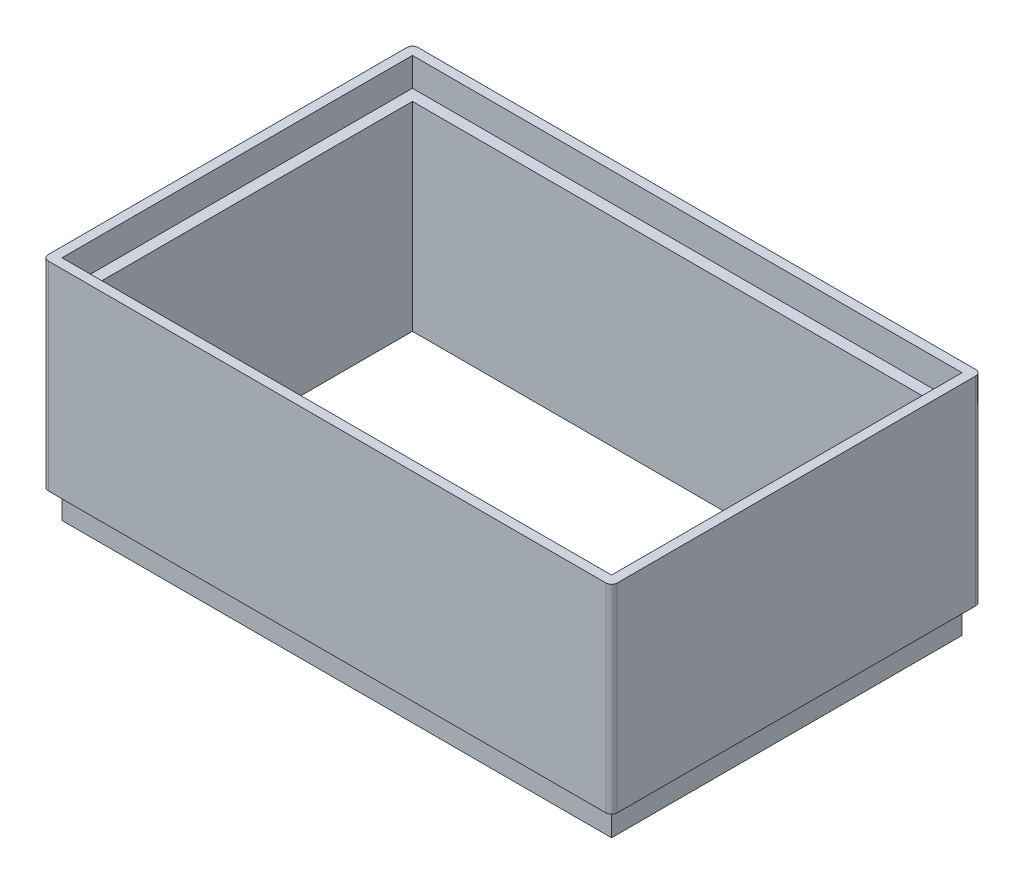
ISO-10303-21;
HEADER;
FILE_DESCRIPTION(('STEP AP214'),'2;1');
FILE_NAME('part.step','',(''),(''),'','','');
FILE_SCHEMA(('AUTOMOTIVE_DESIGN { 1 0 10303 214 1 1 1 1 }'));
ENDSEC;
DATA;
#1=APPLICATION_CONTEXT('core data for automotive mechanical design processes');
#2=APPLICATION_PROTOCOL_DEFINITION('international standard','automotive_design',2000,#1);
#3=PRODUCT_CONTEXT('',#1,'mechanical');
#4=PRODUCT('Part','Part','',(#3));
#5=PRODUCT_RELATED_PRODUCT_CATEGORY('part','',(#4));
#6=PRODUCT_DEFINITION_FORMATION('','',#4);
#7=PRODUCT_DEFINITION_CONTEXT('part definition',#1,'design');
#8=PRODUCT_DEFINITION('design','',#6,#7);
#9=PRODUCT_DEFINITION_SHAPE('','',#8);
#10=(LENGTH_UNIT() NAMED_UNIT(*) SI_UNIT(.MILLI.,.METRE.));
#11=(NAMED_UNIT(*) PLANE_ANGLE_UNIT() SI_UNIT($,.RADIAN.));
#12=(NAMED_UNIT(*) SI_UNIT($,.STERADIAN.) SOLID_ANGLE_UNIT());
#13=UNCERTAINTY_MEASURE_WITH_UNIT(LENGTH_MEASURE(1.E-05),#10,'distance_accuracy_value','');
#14=(GEOMETRIC_REPRESENTATION_CONTEXT(3) GLOBAL_UNCERTAINTY_ASSIGNED_CONTEXT((#13)) GLOBAL_UNIT_ASSIGNED_CONTEXT((#10,
#11,#12)) REPRESENTATION_CONTEXT('',''));
#15=CARTESIAN_POINT('',(0.,0.,0.));
#16=DIRECTION('',(0.,0.,1.));
#17=DIRECTION('',(1.,0.,0.));
#18=AXIS2_PLACEMENT_3D('',#15,#16,#17);
#19=CARTESIAN_POINT('',(47.5395437262358,80.002,-39.1555133079848));
#20=DIRECTION('',(0.,0.,-1.));
#21=DIRECTION('',(-1.,0.,0.));
#22=AXIS2_PLACEMENT_3D('',#19,#20,#21);
#23=PLANE('',#22);
#24=DIRECTION('',(1.,0.,0.));
#25=VECTOR('',#24,1.);
#26=CARTESIAN_POINT('',(47.5395437262358,70.,-39.1555133079848));
#27=LINE('',#26,#25);
#28=CARTESIAN_POINT('',(-45.0604562737642,70.,-39.1555133079848));
#29=VERTEX_POINT('',#28);
#30=CARTESIAN_POINT('',(47.5395437262358,70.,-39.1555133079848));
#31=VERTEX_POINT('',#30);
#32=EDGE_CURVE('E209',#29,#31,#27,.T.);
#33=ORIENTED_EDGE('',*,*,#32,.F.);
#34=DIRECTION('',(0.,-1.,0.));
#35=VECTOR('',#34,1.);
#36=CARTESIAN_POINT('',(-45.0604562737642,80.002,-39.1555133079848));
#37=LINE('',#36,#35);
#38=CARTESIAN_POINT('',(-45.0604562737642,35.,-39.1555133079848));
#39=VERTEX_POINT('',#38);
#40=EDGE_CURVE('E318',#29,#39,#37,.T.);
#41=ORIENTED_EDGE('',*,*,#40,.T.);
#42=DIRECTION('',(1.,0.,0.));
#43=VECTOR('',#42,1.);
#44=CARTESIAN_POINT('',(47.5395437262358,35.,-39.1555133079848));
#45=LINE('',#44,#43);
#46=CARTESIAN_POINT('',(47.5395437262358,35.,-39.1555133079848));
#47=VERTEX_POINT('',#46);
#48=EDGE_CURVE('E263',#39,#47,#45,.T.);
#49=ORIENTED_EDGE('',*,*,#48,.T.);
#50=DIRECTION('',(0.,-1.,0.));
#51=VECTOR('',#50,1.);
#52=CARTESIAN_POINT('',(47.5395437262358,80.002,-39.1555133079848));
#53=LINE('',#52,#51);
#54=EDGE_CURVE('E235',#31,#47,#53,.T.);
#55=ORIENTED_EDGE('',*,*,#54,.F.);
#56=EDGE_LOOP('',(#33,#41,#49,#55));
#57=FACE_BOUND('',#56,.T.);
#58=ADVANCED_FACE('F32',(#57),#23,.F.);
#59=CARTESIAN_POINT('',(-45.0604562737642,80.002,-39.1555133079848));
#60=DIRECTION('',(-1.,0.,0.));
#61=DIRECTION('',(0.,0.,1.));
#62=AXIS2_PLACEMENT_3D('',#59,#60,#61);
#63=PLANE('',#62);
#64=DIRECTION('',(0.,0.,-1.));
#65=VECTOR('',#64,1.);
#66=CARTESIAN_POINT('',(-45.0604562737642,70.,-39.1555133079848));
#67=LINE('',#66,#65);
#68=CARTESIAN_POINT('',(-45.0604562737642,70.,18.4444866920152));
#69=VERTEX_POINT('',#68);
#70=EDGE_CURVE('E207',#69,#29,#67,.T.);
#71=ORIENTED_EDGE('',*,*,#70,.F.);
#72=DIRECTION('',(0.,-1.,0.));
#73=VECTOR('',#72,1.);
#74=CARTESIAN_POINT('',(-45.0604562737642,80.002,18.4444866920152));
#75=LINE('',#74,#73);
#76=CARTESIAN_POINT('',(-45.0604562737642,35.,18.4444866920152));
#77=VERTEX_POINT('',#76);
#78=EDGE_CURVE('E320',#69,#77,#75,.T.);
#79=ORIENTED_EDGE('',*,*,#78,.T.);
#80=DIRECTION('',(0.,0.,-1.));
#81=VECTOR('',#80,1.);
#82=CARTESIAN_POINT('',(-45.0604562737642,35.,-39.1555133079848));
#83=LINE('',#82,#81);
#84=EDGE_CURVE('E273',#77,#39,#83,.T.);
#85=ORIENTED_EDGE('',*,*,#84,.T.);
#86=ORIENTED_EDGE('',*,*,#40,.F.);
#87=EDGE_LOOP('',(#71,#79,#85,#86));
#88=FACE_BOUND('',#87,.T.);
#89=ADVANCED_FACE('F337',(#88),#63,.F.);
#90=CARTESIAN_POINT('',(47.5395437262358,80.002,-39.1555133079848));
#91=DIRECTION('',(1.,0.,0.));
#92=DIRECTION('',(0.,0.,-1.));
#93=AXIS2_PLACEMENT_3D('',#90,#91,#92);
#94=PLANE('',#93);
#95=DIRECTION('',(0.,0.,1.));
#96=VECTOR('',#95,1.);
#97=CARTESIAN_POINT('',(47.5395437262358,70.,-39.1555133079848));
#98=LINE('',#97,#96);
#99=CARTESIAN_POINT('',(47.5395437262358,70.,18.4444866920152));
#100=VERTEX_POINT('',#99);
#101=EDGE_CURVE('E54',#31,#100,#98,.T.);
#102=ORIENTED_EDGE('',*,*,#101,.F.);
#103=ORIENTED_EDGE('',*,*,#54,.T.);
#104=DIRECTION('',(0.,0.,1.));
#105=VECTOR('',#104,1.);
#106=CARTESIAN_POINT('',(47.5395437262358,35.,-39.1555133079848));
#107=LINE('',#106,#105);
#108=CARTESIAN_POINT('',(47.5395437262358,35.,18.4444866920152));
#109=VERTEX_POINT('',#108);
#110=EDGE_CURVE('E40',#47,#109,#107,.T.);
#111=ORIENTED_EDGE('',*,*,#110,.T.);
#112=DIRECTION('',(0.,-1.,0.));
#113=VECTOR('',#112,1.);
#114=CARTESIAN_POINT('',(47.5395437262358,80.002,18.4444866920152));
#115=LINE('',#114,#113);
#116=EDGE_CURVE('E240',#100,#109,#115,.T.);
#117=ORIENTED_EDGE('',*,*,#116,.F.);
#118=EDGE_LOOP('',(#102,#103,#111,#117));
#119=FACE_BOUND('',#118,.T.);
#120=ADVANCED_FACE('F329',(#119),#94,.F.);
#121=CARTESIAN_POINT('',(47.5395437262358,80.002,18.4444866920152));
#122=DIRECTION('',(0.,0.,1.));
#123=DIRECTION('',(1.,0.,0.));
#124=AXIS2_PLACEMENT_3D('',#121,#122,#123);
#125=PLANE('',#124);
#126=DIRECTION('',(-1.,0.,0.));
#127=VECTOR('',#126,1.);
#128=CARTESIAN_POINT('',(47.5395437262358,70.,18.4444866920152));
#129=LINE('',#128,#127);
#130=EDGE_CURVE('E11',#100,#69,#129,.T.);
#131=ORIENTED_EDGE('',*,*,#130,.F.);
#132=ORIENTED_EDGE('',*,*,#116,.T.);
#133=DIRECTION('',(-1.,0.,0.));
#134=VECTOR('',#133,1.);
#135=CARTESIAN_POINT('',(47.5395437262358,35.,18.4444866920152));
#136=LINE('',#135,#134);
#137=EDGE_CURVE('E276',#109,#77,#136,.T.);
#138=ORIENTED_EDGE('',*,*,#137,.T.);
#139=ORIENTED_EDGE('',*,*,#78,.F.);
#140=EDGE_LOOP('',(#131,#132,#138,#139));
#141=FACE_BOUND('',#140,.T.);
#142=ADVANCED_FACE('F323',(#141),#125,.F.);
#143=CARTESIAN_POINT('',(0.,75.,0.));
#144=DIRECTION('',(0.,1.,0.));
#145=DIRECTION('',(0.,0.,1.));
#146=AXIS2_PLACEMENT_3D('',#143,#144,#145);
#147=PLANE('',#146);
#148=DIRECTION('',(0.,0.,1.));
#149=VECTOR('',#148,1.);
#150=CARTESIAN_POINT('',(-47.0604562737643,75.,-41.1555133079848));
#151=LINE('',#150,#149);
#152=CARTESIAN_POINT('',(-47.0604562737643,75.,-41.1555133079848));
#153=VERTEX_POINT('',#152);
#154=CARTESIAN_POINT('',(-47.0604562737643,75.,20.4444866920152));
#155=VERTEX_POINT('',#154);
#156=EDGE_CURVE('E47',#153,#155,#151,.T.);
#157=ORIENTED_EDGE('',*,*,#156,.F.);
#158=DIRECTION('',(-1.,0.,0.));
#159=VECTOR('',#158,1.);
#160=CARTESIAN_POINT('',(-47.0604562737643,75.,-41.1555133079848));
#161=LINE('',#160,#159);
#162=CARTESIAN_POINT('',(49.5395437262358,75.,-41.1555133079848));
#163=VERTEX_POINT('',#162);
#164=EDGE_CURVE('E188',#163,#153,#161,.T.);
#165=ORIENTED_EDGE('',*,*,#164,.F.);
#166=DIRECTION('',(0.,0.,-1.));
#167=VECTOR('',#166,1.);
#168=CARTESIAN_POINT('',(49.5395437262358,75.,-41.1555133079848));
#169=LINE('',#168,#167);
#170=CARTESIAN_POINT('',(49.5395437262358,75.,20.4444866920152));
#171=VERTEX_POINT('',#170);
#172=EDGE_CURVE('E191',#171,#163,#169,.T.);
#173=ORIENTED_EDGE('',*,*,#172,.F.);
#174=DIRECTION('',(1.,0.,0.));
#175=VECTOR('',#174,1.);
#176=CARTESIAN_POINT('',(-47.0604562737643,75.,20.4444866920152));
#177=LINE('',#176,#175);
#178=EDGE_CURVE('E197',#155,#171,#177,.T.);
#179=ORIENTED_EDGE('',*,*,#178,.F.);
#180=EDGE_LOOP('',(#157,#165,#173,#179));
#181=FACE_BOUND('',#180,.T.);
#182=CARTESIAN_POINT('',(-47.7604562737643,75.,21.1444866920152));
#183=DIRECTION('',(0.,1.,0.));
#184=DIRECTION('',(0.,0.,1.));
#185=AXIS2_PLACEMENT_3D('',#182,#183,#184);
#186=CIRCLE('',#185,1.);
#187=CARTESIAN_POINT('',(-47.7604562737643,75.,22.1444866920152));
#188=VERTEX_POINT('',#187);
#189=CARTESIAN_POINT('',(-48.7604562737643,75.,21.1444866920152));
#190=VERTEX_POINT('',#189);
#191=EDGE_CURVE('E286',#188,#190,#186,.F.);
#192=ORIENTED_EDGE('',*,*,#191,.F.);
#193=DIRECTION('',(1.,0.,0.));
#194=VECTOR('',#193,1.);
#195=CARTESIAN_POINT('',(-48.7604562737643,75.,22.1444866920152));
#196=LINE('',#195,#194);
#197=CARTESIAN_POINT('',(50.2395437262358,75.,22.1444866920152));
#198=VERTEX_POINT('',#197);
#199=EDGE_CURVE('E288',#188,#198,#196,.T.);
#200=ORIENTED_EDGE('',*,*,#199,.T.);
#201=CARTESIAN_POINT('',(50.2395437262358,75.,21.1444866920152));
#202=DIRECTION('',(0.,1.,0.));
#203=DIRECTION('',(0.,0.,1.));
#204=AXIS2_PLACEMENT_3D('',#201,#202,#203);
#205=CIRCLE('',#204,1.);
#206=CARTESIAN_POINT('',(51.2395437262358,75.,21.1444866920152));
#207=VERTEX_POINT('',#206);
#208=EDGE_CURVE('E282',#207,#198,#205,.F.);
#209=ORIENTED_EDGE('',*,*,#208,.F.);
#210=DIRECTION('',(0.,0.,-1.));
#211=VECTOR('',#210,1.);
#212=CARTESIAN_POINT('',(51.2395437262357,75.,-42.8555133079848));
#213=LINE('',#212,#211);
#214=CARTESIAN_POINT('',(51.2395437262357,75.,-41.8555133079848));
#215=VERTEX_POINT('',#214);
#216=EDGE_CURVE('E294',#207,#215,#213,.T.);
#217=ORIENTED_EDGE('',*,*,#216,.T.);
#218=CARTESIAN_POINT('',(50.2395437262357,75.,-41.8555133079848));
#219=DIRECTION('',(0.,1.,0.));
#220=DIRECTION('',(0.,0.,1.));
#221=AXIS2_PLACEMENT_3D('',#218,#219,#220);
#222=CIRCLE('',#221,1.);
#223=CARTESIAN_POINT('',(50.2395437262357,75.,-42.8555133079848));
#224=VERTEX_POINT('',#223);
#225=EDGE_CURVE('E215',#224,#215,#222,.F.);
#226=ORIENTED_EDGE('',*,*,#225,.F.);
#227=DIRECTION('',(-1.,0.,0.));
#228=VECTOR('',#227,1.);
#229=CARTESIAN_POINT('',(-48.7604562737643,75.,-42.8555133079848));
#230=LINE('',#229,#228);
#231=CARTESIAN_POINT('',(-47.7604562737643,75.,-42.8555133079848));
#232=VERTEX_POINT('',#231);
#233=EDGE_CURVE('E211',#224,#232,#230,.T.);
#234=ORIENTED_EDGE('',*,*,#233,.T.);
#235=CARTESIAN_POINT('',(-47.7604562737643,75.,-41.8555133079848));
#236=DIRECTION('',(0.,1.,0.));
#237=DIRECTION('',(0.,0.,1.));
#238=AXIS2_PLACEMENT_3D('',#235,#236,#237);
#239=CIRCLE('',#238,1.);
#240=CARTESIAN_POINT('',(-48.7604562737643,75.,-41.8555133079848));
#241=VERTEX_POINT('',#240);
#242=EDGE_CURVE('E284',#241,#232,#239,.F.);
#243=ORIENTED_EDGE('',*,*,#242,.F.);
#244=DIRECTION('',(0.,0.,1.));
#245=VECTOR('',#244,1.);
#246=CARTESIAN_POINT('',(-48.7604562737643,75.,-42.8555133079848));
#247=LINE('',#246,#245);
#248=EDGE_CURVE('E291',#241,#190,#247,.T.);
#249=ORIENTED_EDGE('',*,*,#248,.T.);
#250=EDGE_LOOP('',(#192,#200,#209,#217,#226,#234,#243,#249));
#251=FACE_BOUND('',#250,.T.);
#252=ADVANCED_FACE('F353',(#181,#251),#147,.T.);
#253=CARTESIAN_POINT('',(-47.0604562737643,35.,-41.1555133079848));
#254=DIRECTION('',(0.,0.,1.));
#255=DIRECTION('',(1.,0.,0.));
#256=AXIS2_PLACEMENT_3D('',#253,#254,#255);
#257=PLANE('',#256);
#258=DIRECTION('',(1.,0.,0.));
#259=VECTOR('',#258,1.);
#260=CARTESIAN_POINT('',(-47.0604562737643,40.,-41.1555133079848));
#261=LINE('',#260,#259);
#262=CARTESIAN_POINT('',(-47.0604562737643,40.,-41.1555133079848));
#263=VERTEX_POINT('',#262);
#264=CARTESIAN_POINT('',(49.5395437262358,40.,-41.1555133079848));
#265=VERTEX_POINT('',#264);
#266=EDGE_CURVE('E257',#263,#265,#261,.T.);
#267=ORIENTED_EDGE('',*,*,#266,.T.);
#268=DIRECTION('',(0.,1.,0.));
#269=VECTOR('',#268,1.);
#270=CARTESIAN_POINT('',(49.5395437262358,35.,-41.1555133079848));
#271=LINE('',#270,#269);
#272=CARTESIAN_POINT('',(49.5395437262358,35.,-41.1555133079848));
#273=VERTEX_POINT('',#272);
#274=EDGE_CURVE('E239',#273,#265,#271,.T.);
#275=ORIENTED_EDGE('',*,*,#274,.F.);
#276=DIRECTION('',(1.,0.,0.));
#277=VECTOR('',#276,1.);
#278=CARTESIAN_POINT('',(-47.0604562737643,35.,-41.1555133079848));
#279=LINE('',#278,#277);
#280=CARTESIAN_POINT('',(-47.0604562737643,35.,-41.1555133079848));
#281=VERTEX_POINT('',#280);
#282=EDGE_CURVE('E267',#281,#273,#279,.T.);
#283=ORIENTED_EDGE('',*,*,#282,.F.);
#284=DIRECTION('',(0.,1.,0.));
#285=VECTOR('',#284,1.);
#286=CARTESIAN_POINT('',(-47.0604562737643,35.,-41.1555133079848));
#287=LINE('',#286,#285);
#288=EDGE_CURVE('E236',#281,#263,#287,.T.);
#289=ORIENTED_EDGE('',*,*,#288,.T.);
#290=EDGE_LOOP('',(#267,#275,#283,#289));
#291=FACE_BOUND('',#290,.T.);
#292=ADVANCED_FACE('F354',(#291),#257,.F.);
#293=CARTESIAN_POINT('',(49.5395437262358,35.,20.4444866920152));
#294=DIRECTION('',(-1.,0.,0.));
#295=DIRECTION('',(0.,0.,1.));
#296=AXIS2_PLACEMENT_3D('',#293,#294,#295);
#297=PLANE('',#296);
#298=DIRECTION('',(0.,0.,1.));
#299=VECTOR('',#298,1.);
#300=CARTESIAN_POINT('',(49.5395437262358,40.,20.4444866920152));
#301=LINE('',#300,#299);
#302=CARTESIAN_POINT('',(49.5395437262358,40.,20.4444866920152));
#303=VERTEX_POINT('',#302);
#304=EDGE_CURVE('E253',#265,#303,#301,.T.);
#305=ORIENTED_EDGE('',*,*,#304,.T.);
#306=DIRECTION('',(0.,1.,0.));
#307=VECTOR('',#306,1.);
#308=CARTESIAN_POINT('',(49.5395437262358,35.,20.4444866920152));
#309=LINE('',#308,#307);
#310=CARTESIAN_POINT('',(49.5395437262358,35.,20.4444866920152));
#311=VERTEX_POINT('',#310);
#312=EDGE_CURVE('E243',#311,#303,#309,.T.);
#313=ORIENTED_EDGE('',*,*,#312,.F.);
#314=DIRECTION('',(0.,0.,1.));
#315=VECTOR('',#314,1.);
#316=CARTESIAN_POINT('',(49.5395437262358,35.,20.4444866920152));
#317=LINE('',#316,#315);
#318=EDGE_CURVE('E265',#273,#311,#317,.T.);
#319=ORIENTED_EDGE('',*,*,#318,.F.);
#320=ORIENTED_EDGE('',*,*,#274,.T.);
#321=EDGE_LOOP('',(#305,#313,#319,#320));
#322=FACE_BOUND('',#321,.T.);
#323=ADVANCED_FACE('F423',(#322),#297,.F.);
#324=CARTESIAN_POINT('',(-47.0604562737643,35.,20.4444866920152));
#325=DIRECTION('',(0.,0.,-1.));
#326=DIRECTION('',(-1.,0.,0.));
#327=AXIS2_PLACEMENT_3D('',#324,#325,#326);
#328=PLANE('',#327);
#329=DIRECTION('',(-1.,0.,0.));
#330=VECTOR('',#329,1.);
#331=CARTESIAN_POINT('',(-47.0604562737643,40.,20.4444866920152));
#332=LINE('',#331,#330);
#333=CARTESIAN_POINT('',(-47.0604562737643,40.,20.4444866920152));
#334=VERTEX_POINT('',#333);
#335=EDGE_CURVE('E250',#303,#334,#332,.T.);
#336=ORIENTED_EDGE('',*,*,#335,.T.);
#337=DIRECTION('',(0.,1.,0.));
#338=VECTOR('',#337,1.);
#339=CARTESIAN_POINT('',(-47.0604562737643,35.,20.4444866920152));
#340=LINE('',#339,#338);
#341=CARTESIAN_POINT('',(-47.0604562737643,35.,20.4444866920152));
#342=VERTEX_POINT('',#341);
#343=EDGE_CURVE('E246',#342,#334,#340,.T.);
#344=ORIENTED_EDGE('',*,*,#343,.F.);
#345=DIRECTION('',(-1.,0.,0.));
#346=VECTOR('',#345,1.);
#347=CARTESIAN_POINT('',(-47.0604562737643,35.,20.4444866920152));
#348=LINE('',#347,#346);
#349=EDGE_CURVE('E249',#311,#342,#348,.T.);
#350=ORIENTED_EDGE('',*,*,#349,.F.);
#351=ORIENTED_EDGE('',*,*,#312,.T.);
#352=EDGE_LOOP('',(#336,#344,#350,#351));
#353=FACE_BOUND('',#352,.T.);
#354=ADVANCED_FACE('F420',(#353),#328,.F.);
#355=CARTESIAN_POINT('',(-47.0604562737643,35.,20.4444866920152));
#356=DIRECTION('',(1.,0.,0.));
#357=DIRECTION('',(0.,0.,-1.));
#358=AXIS2_PLACEMENT_3D('',#355,#356,#357);
#359=PLANE('',#358);
#360=DIRECTION('',(0.,0.,-1.));
#361=VECTOR('',#360,1.);
#362=CARTESIAN_POINT('',(-47.0604562737643,40.,20.4444866920152));
#363=LINE('',#362,#361);
#364=EDGE_CURVE('E260',#334,#263,#363,.T.);
#365=ORIENTED_EDGE('',*,*,#364,.T.);
#366=ORIENTED_EDGE('',*,*,#288,.F.);
#367=DIRECTION('',(0.,0.,-1.));
#368=VECTOR('',#367,1.);
#369=CARTESIAN_POINT('',(-47.0604562737643,35.,20.4444866920152));
#370=LINE('',#369,#368);
#371=EDGE_CURVE('E254',#342,#281,#370,.T.);
#372=ORIENTED_EDGE('',*,*,#371,.F.);
#373=ORIENTED_EDGE('',*,*,#343,.T.);
#374=EDGE_LOOP('',(#365,#366,#372,#373));
#375=FACE_BOUND('',#374,.T.);
#376=ADVANCED_FACE('F413',(#375),#359,.F.);
#377=CARTESIAN_POINT('',(-48.7604562737643,80.,22.1444866920152));
#378=DIRECTION('',(0.,0.,-1.));
#379=DIRECTION('',(-1.,0.,0.));
#380=AXIS2_PLACEMENT_3D('',#377,#378,#379);
#381=PLANE('',#380);
#382=ORIENTED_EDGE('',*,*,#199,.F.);
#383=DIRECTION('',(0.,-1.,0.));
#384=VECTOR('',#383,1.);
#385=CARTESIAN_POINT('',(-47.7604562737643,80.,22.1444866920152));
#386=LINE('',#385,#384);
#387=CARTESIAN_POINT('',(-47.7604562737643,40.,22.1444866920152));
#388=VERTEX_POINT('',#387);
#389=EDGE_CURVE('E301',#188,#388,#386,.T.);
#390=ORIENTED_EDGE('',*,*,#389,.T.);
#391=DIRECTION('',(1.,0.,0.));
#392=VECTOR('',#391,1.);
#393=CARTESIAN_POINT('',(-48.7604562737643,40.,22.1444866920152));
#394=LINE('',#393,#392);
#395=CARTESIAN_POINT('',(50.2395437262358,40.,22.1444866920152));
#396=VERTEX_POINT('',#395);
#397=EDGE_CURVE('E225',#388,#396,#394,.T.);
#398=ORIENTED_EDGE('',*,*,#397,.T.);
#399=DIRECTION('',(0.,-1.,0.));
#400=VECTOR('',#399,1.);
#401=CARTESIAN_POINT('',(50.2395437262358,80.,22.1444866920152));
#402=LINE('',#401,#400);
#403=EDGE_CURVE('E221',#396,#198,#402,.F.);
#404=ORIENTED_EDGE('',*,*,#403,.T.);
#405=EDGE_LOOP('',(#382,#390,#398,#404));
#406=FACE_BOUND('',#405,.T.);
#407=ADVANCED_FACE('F395',(#406),#381,.F.);
#408=CARTESIAN_POINT('',(0.,40.,0.));
#409=DIRECTION('',(0.,1.,0.));
#410=DIRECTION('',(0.,0.,1.));
#411=AXIS2_PLACEMENT_3D('',#408,#409,#410);
#412=PLANE('',#411);
#413=DIRECTION('',(0.,0.,-1.));
#414=VECTOR('',#413,1.);
#415=CARTESIAN_POINT('',(51.2395437262357,40.,-42.8555133079848));
#416=LINE('',#415,#414);
#417=CARTESIAN_POINT('',(51.2395437262358,40.,21.1444866920152));
#418=VERTEX_POINT('',#417);
#419=CARTESIAN_POINT('',(51.2395437262357,40.,-41.8555133079848));
#420=VERTEX_POINT('',#419);
#421=EDGE_CURVE('E229',#418,#420,#416,.T.);
#422=ORIENTED_EDGE('',*,*,#421,.F.);
#423=CARTESIAN_POINT('',(50.2395437262358,40.,21.1444866920152));
#424=DIRECTION('',(0.,1.,0.));
#425=DIRECTION('',(0.,0.,1.));
#426=AXIS2_PLACEMENT_3D('',#423,#424,#425);
#427=CIRCLE('',#426,1.);
#428=EDGE_CURVE('E212',#418,#396,#427,.F.);
#429=ORIENTED_EDGE('',*,*,#428,.T.);
#430=ORIENTED_EDGE('',*,*,#397,.F.);
#431=CARTESIAN_POINT('',(-47.7604562737643,40.,21.1444866920152));
#432=DIRECTION('',(0.,1.,0.));
#433=DIRECTION('',(0.,0.,1.));
#434=AXIS2_PLACEMENT_3D('',#431,#432,#433);
#435=CIRCLE('',#434,1.);
#436=CARTESIAN_POINT('',(-48.7604562737643,40.,21.1444866920152));
#437=VERTEX_POINT('',#436);
#438=EDGE_CURVE('E214',#388,#437,#435,.F.);
#439=ORIENTED_EDGE('',*,*,#438,.T.);
#440=DIRECTION('',(0.,0.,1.));
#441=VECTOR('',#440,1.);
#442=CARTESIAN_POINT('',(-48.7604562737643,40.,-42.8555133079848));
#443=LINE('',#442,#441);
#444=CARTESIAN_POINT('',(-48.7604562737643,40.,-41.8555133079848));
#445=VERTEX_POINT('',#444);
#446=EDGE_CURVE('E222',#445,#437,#443,.T.);
#447=ORIENTED_EDGE('',*,*,#446,.F.);
#448=CARTESIAN_POINT('',(-47.7604562737643,40.,-41.8555133079848));
#449=DIRECTION('',(0.,1.,0.));
#450=DIRECTION('',(0.,0.,1.));
#451=AXIS2_PLACEMENT_3D('',#448,#449,#450);
#452=CIRCLE('',#451,1.);
#453=CARTESIAN_POINT('',(-47.7604562737643,40.,-42.8555133079848));
#454=VERTEX_POINT('',#453);
#455=EDGE_CURVE('E217',#445,#454,#452,.F.);
#456=ORIENTED_EDGE('',*,*,#455,.T.);
#457=DIRECTION('',(-1.,0.,0.));
#458=VECTOR('',#457,1.);
#459=CARTESIAN_POINT('',(-48.7604562737643,40.,-42.8555133079848));
#460=LINE('',#459,#458);
#461=CARTESIAN_POINT('',(50.2395437262357,40.,-42.8555133079848));
#462=VERTEX_POINT('',#461);
#463=EDGE_CURVE('E232',#462,#454,#460,.T.);
#464=ORIENTED_EDGE('',*,*,#463,.F.);
#465=CARTESIAN_POINT('',(50.2395437262357,40.,-41.8555133079848));
#466=DIRECTION('',(0.,1.,0.));
#467=DIRECTION('',(0.,0.,1.));
#468=AXIS2_PLACEMENT_3D('',#465,#466,#467);
#469=CIRCLE('',#468,1.);
#470=EDGE_CURVE('E219',#462,#420,#469,.F.);
#471=ORIENTED_EDGE('',*,*,#470,.T.);
#472=EDGE_LOOP('',(#422,#429,#430,#439,#447,#456,#464,#471));
#473=FACE_BOUND('',#472,.T.);
#474=ORIENTED_EDGE('',*,*,#364,.F.);
#475=ORIENTED_EDGE('',*,*,#335,.F.);
#476=ORIENTED_EDGE('',*,*,#304,.F.);
#477=ORIENTED_EDGE('',*,*,#266,.F.);
#478=EDGE_LOOP('',(#474,#475,#476,#477));
#479=FACE_BOUND('',#478,.T.);
#480=ADVANCED_FACE('F384',(#473,#479),#412,.F.);
#481=CARTESIAN_POINT('',(51.2395437262357,80.,-42.8555133079848));
#482=DIRECTION('',(-1.,0.,0.));
#483=DIRECTION('',(0.,0.,1.));
#484=AXIS2_PLACEMENT_3D('',#481,#482,#483);
#485=PLANE('',#484);
#486=ORIENTED_EDGE('',*,*,#216,.F.);
#487=DIRECTION('',(0.,-1.,0.));
#488=VECTOR('',#487,1.);
#489=CARTESIAN_POINT('',(51.2395437262358,80.,21.1444866920152));
#490=LINE('',#489,#488);
#491=EDGE_CURVE('E313',#207,#418,#490,.T.);
#492=ORIENTED_EDGE('',*,*,#491,.T.);
#493=ORIENTED_EDGE('',*,*,#421,.T.);
#494=DIRECTION('',(0.,-1.,0.));
#495=VECTOR('',#494,1.);
#496=CARTESIAN_POINT('',(51.2395437262357,80.,-41.8555133079848));
#497=LINE('',#496,#495);
#498=EDGE_CURVE('E226',#420,#215,#497,.F.);
#499=ORIENTED_EDGE('',*,*,#498,.T.);
#500=EDGE_LOOP('',(#486,#492,#493,#499));
#501=FACE_BOUND('',#500,.T.);
#502=ADVANCED_FACE('F381',(#501),#485,.F.);
#503=CARTESIAN_POINT('',(-48.7604562737643,80.,-42.8555133079848));
#504=DIRECTION('',(0.,0.,1.));
#505=DIRECTION('',(1.,0.,0.));
#506=AXIS2_PLACEMENT_3D('',#503,#504,#505);
#507=PLANE('',#506);
#508=ORIENTED_EDGE('',*,*,#233,.F.);
#509=DIRECTION('',(0.,-1.,0.));
#510=VECTOR('',#509,1.);
#511=CARTESIAN_POINT('',(50.2395437262357,80.,-42.8555133079848));
#512=LINE('',#511,#510);
#513=EDGE_CURVE('E311',#224,#462,#512,.T.);
#514=ORIENTED_EDGE('',*,*,#513,.T.);
#515=ORIENTED_EDGE('',*,*,#463,.T.);
#516=DIRECTION('',(0.,-1.,0.));
#517=VECTOR('',#516,1.);
#518=CARTESIAN_POINT('',(-47.7604562737643,80.,-42.8555133079848));
#519=LINE('',#518,#517);
#520=EDGE_CURVE('E308',#454,#232,#519,.F.);
#521=ORIENTED_EDGE('',*,*,#520,.T.);
#522=EDGE_LOOP('',(#508,#514,#515,#521));
#523=FACE_BOUND('',#522,.T.);
#524=ADVANCED_FACE('F373',(#523),#507,.F.);
#525=CARTESIAN_POINT('',(50.2395437262357,80.,-41.8555133079848));
#526=DIRECTION('',(0.,-1.,0.));
#527=DIRECTION('',(0.,0.,-1.));
#528=AXIS2_PLACEMENT_3D('',#525,#526,#527);
#529=CYLINDRICAL_SURFACE('',#528,1.);
#530=ORIENTED_EDGE('',*,*,#513,.F.);
#531=ORIENTED_EDGE('',*,*,#225,.T.);
#532=ORIENTED_EDGE('',*,*,#498,.F.);
#533=ORIENTED_EDGE('',*,*,#470,.F.);
#534=EDGE_LOOP('',(#530,#531,#532,#533));
#535=FACE_BOUND('',#534,.T.);
#536=ADVANCED_FACE('F34',(#535),#529,.T.);
#537=CARTESIAN_POINT('',(50.2395437262358,80.,21.1444866920152));
#538=DIRECTION('',(0.,-1.,0.));
#539=DIRECTION('',(0.,0.,-1.));
#540=AXIS2_PLACEMENT_3D('',#537,#538,#539);
#541=CYLINDRICAL_SURFACE('',#540,1.);
#542=ORIENTED_EDGE('',*,*,#491,.F.);
#543=ORIENTED_EDGE('',*,*,#208,.T.);
#544=ORIENTED_EDGE('',*,*,#403,.F.);
#545=ORIENTED_EDGE('',*,*,#428,.F.);
#546=EDGE_LOOP('',(#542,#543,#544,#545));
#547=FACE_BOUND('',#546,.T.);
#548=ADVANCED_FACE('F363',(#547),#541,.T.);
#549=CARTESIAN_POINT('',(-48.7604562737643,80.,-42.8555133079848));
#550=DIRECTION('',(1.,0.,0.));
#551=DIRECTION('',(0.,0.,-1.));
#552=AXIS2_PLACEMENT_3D('',#549,#550,#551);
#553=PLANE('',#552);
#554=ORIENTED_EDGE('',*,*,#248,.F.);
#555=DIRECTION('',(0.,-1.,0.));
#556=VECTOR('',#555,1.);
#557=CARTESIAN_POINT('',(-48.7604562737643,80.,-41.8555133079848));
#558=LINE('',#557,#556);
#559=EDGE_CURVE('E306',#241,#445,#558,.T.);
#560=ORIENTED_EDGE('',*,*,#559,.T.);
#561=ORIENTED_EDGE('',*,*,#446,.T.);
#562=DIRECTION('',(0.,-1.,0.));
#563=VECTOR('',#562,1.);
#564=CARTESIAN_POINT('',(-48.7604562737643,80.,21.1444866920152));
#565=LINE('',#564,#563);
#566=EDGE_CURVE('E303',#437,#190,#565,.F.);
#567=ORIENTED_EDGE('',*,*,#566,.T.);
#568=EDGE_LOOP('',(#554,#560,#561,#567));
#569=FACE_BOUND('',#568,.T.);
#570=ADVANCED_FACE('F361',(#569),#553,.F.);
#571=CARTESIAN_POINT('',(-47.7604562737643,80.,-41.8555133079848));
#572=DIRECTION('',(0.,-1.,0.));
#573=DIRECTION('',(0.,0.,-1.));
#574=AXIS2_PLACEMENT_3D('',#571,#572,#573);
#575=CYLINDRICAL_SURFACE('',#574,1.);
#576=ORIENTED_EDGE('',*,*,#559,.F.);
#577=ORIENTED_EDGE('',*,*,#242,.T.);
#578=ORIENTED_EDGE('',*,*,#520,.F.);
#579=ORIENTED_EDGE('',*,*,#455,.F.);
#580=EDGE_LOOP('',(#576,#577,#578,#579));
#581=FACE_BOUND('',#580,.T.);
#582=ADVANCED_FACE('F358',(#581),#575,.T.);
#583=CARTESIAN_POINT('',(-47.7604562737643,80.,21.1444866920152));
#584=DIRECTION('',(0.,-1.,0.));
#585=DIRECTION('',(0.,0.,-1.));
#586=AXIS2_PLACEMENT_3D('',#583,#584,#585);
#587=CYLINDRICAL_SURFACE('',#586,1.);
#588=ORIENTED_EDGE('',*,*,#389,.F.);
#589=ORIENTED_EDGE('',*,*,#191,.T.);
#590=ORIENTED_EDGE('',*,*,#566,.F.);
#591=ORIENTED_EDGE('',*,*,#438,.F.);
#592=EDGE_LOOP('',(#588,#589,#590,#591));
#593=FACE_BOUND('',#592,.T.);
#594=ADVANCED_FACE('F355',(#593),#587,.T.);
#595=CARTESIAN_POINT('',(0.,35.,0.));
#596=DIRECTION('',(0.,-1.,0.));
#597=DIRECTION('',(0.,0.,-1.));
#598=AXIS2_PLACEMENT_3D('',#595,#596,#597);
#599=PLANE('',#598);
#600=ORIENTED_EDGE('',*,*,#371,.T.);
#601=ORIENTED_EDGE('',*,*,#282,.T.);
#602=ORIENTED_EDGE('',*,*,#318,.T.);
#603=ORIENTED_EDGE('',*,*,#349,.T.);
#604=EDGE_LOOP('',(#600,#601,#602,#603));
#605=FACE_BOUND('',#604,.T.);
#606=ORIENTED_EDGE('',*,*,#137,.F.);
#607=ORIENTED_EDGE('',*,*,#110,.F.);
#608=ORIENTED_EDGE('',*,*,#48,.F.);
#609=ORIENTED_EDGE('',*,*,#84,.F.);
#610=EDGE_LOOP('',(#606,#607,#608,#609));
#611=FACE_BOUND('',#610,.T.);
#612=ADVANCED_FACE('F333',(#605,#611),#599,.T.);
#613=CARTESIAN_POINT('',(0.,70.,0.));
#614=DIRECTION('',(0.,1.,0.));
#615=DIRECTION('',(0.,0.,1.));
#616=AXIS2_PLACEMENT_3D('',#613,#614,#615);
#617=PLANE('',#616);
#618=DIRECTION('',(0.,0.,1.));
#619=VECTOR('',#618,1.);
#620=CARTESIAN_POINT('',(-47.0604562737643,70.,-41.1555133079848));
#621=LINE('',#620,#619);
#622=CARTESIAN_POINT('',(-47.0604562737643,70.,-41.1555133079848));
#623=VERTEX_POINT('',#622);
#624=CARTESIAN_POINT('',(-47.0604562737643,70.,20.4444866920152));
#625=VERTEX_POINT('',#624);
#626=EDGE_CURVE('E170',#623,#625,#621,.T.);
#627=ORIENTED_EDGE('',*,*,#626,.T.);
#628=DIRECTION('',(1.,0.,0.));
#629=VECTOR('',#628,1.);
#630=CARTESIAN_POINT('',(-47.0604562737643,70.,20.4444866920152));
#631=LINE('',#630,#629);
#632=CARTESIAN_POINT('',(49.5395437262358,70.,20.4444866920152));
#633=VERTEX_POINT('',#632);
#634=EDGE_CURVE('E179',#625,#633,#631,.T.);
#635=ORIENTED_EDGE('',*,*,#634,.T.);
#636=DIRECTION('',(0.,0.,-1.));
#637=VECTOR('',#636,1.);
#638=CARTESIAN_POINT('',(49.5395437262358,70.,-41.1555133079848));
#639=LINE('',#638,#637);
#640=CARTESIAN_POINT('',(49.5395437262358,70.,-41.1555133079848));
#641=VERTEX_POINT('',#640);
#642=EDGE_CURVE('E184',#633,#641,#639,.T.);
#643=ORIENTED_EDGE('',*,*,#642,.T.);
#644=DIRECTION('',(-1.,0.,0.));
#645=VECTOR('',#644,1.);
#646=CARTESIAN_POINT('',(-47.0604562737643,70.,-41.1555133079848));
#647=LINE('',#646,#645);
#648=EDGE_CURVE('E176',#641,#623,#647,.T.);
#649=ORIENTED_EDGE('',*,*,#648,.T.);
#650=EDGE_LOOP('',(#627,#635,#643,#649));
#651=FACE_BOUND('',#650,.T.);
#652=ORIENTED_EDGE('',*,*,#32,.T.);
#653=ORIENTED_EDGE('',*,*,#101,.T.);
#654=ORIENTED_EDGE('',*,*,#130,.T.);
#655=ORIENTED_EDGE('',*,*,#70,.T.);
#656=EDGE_LOOP('',(#652,#653,#654,#655));
#657=FACE_BOUND('',#656,.T.);
#658=ADVANCED_FACE('F186',(#651,#657),#617,.T.);
#659=CARTESIAN_POINT('',(-47.0604562737643,70.,-41.1555133079848));
#660=DIRECTION('',(-1.,0.,0.));
#661=DIRECTION('',(0.,0.,1.));
#662=AXIS2_PLACEMENT_3D('',#659,#660,#661);
#663=PLANE('',#662);
#664=ORIENTED_EDGE('',*,*,#156,.T.);
#665=DIRECTION('',(0.,1.,0.));
#666=VECTOR('',#665,1.);
#667=CARTESIAN_POINT('',(-47.0604562737643,70.,20.4444866920152));
#668=LINE('',#667,#666);
#669=EDGE_CURVE('E166',#625,#155,#668,.T.);
#670=ORIENTED_EDGE('',*,*,#669,.F.);
#671=ORIENTED_EDGE('',*,*,#626,.F.);
#672=DIRECTION('',(0.,1.,0.));
#673=VECTOR('',#672,1.);
#674=CARTESIAN_POINT('',(-47.0604562737643,70.,-41.1555133079848));
#675=LINE('',#674,#673);
#676=EDGE_CURVE('E201',#623,#153,#675,.T.);
#677=ORIENTED_EDGE('',*,*,#676,.T.);
#678=EDGE_LOOP('',(#664,#670,#671,#677));
#679=FACE_BOUND('',#678,.T.);
#680=ADVANCED_FACE('F168',(#679),#663,.F.);
#681=CARTESIAN_POINT('',(-47.0604562737643,70.,-41.1555133079848));
#682=DIRECTION('',(0.,0.,-1.));
#683=DIRECTION('',(-1.,0.,0.));
#684=AXIS2_PLACEMENT_3D('',#681,#682,#683);
#685=PLANE('',#684);
#686=ORIENTED_EDGE('',*,*,#164,.T.);
#687=ORIENTED_EDGE('',*,*,#676,.F.);
#688=ORIENTED_EDGE('',*,*,#648,.F.);
#689=DIRECTION('',(0.,1.,0.));
#690=VECTOR('',#689,1.);
#691=CARTESIAN_POINT('',(49.5395437262358,70.,-41.1555133079848));
#692=LINE('',#691,#690);
#693=EDGE_CURVE('E203',#641,#163,#692,.T.);
#694=ORIENTED_EDGE('',*,*,#693,.T.);
#695=EDGE_LOOP('',(#686,#687,#688,#694));
#696=FACE_BOUND('',#695,.T.);
#697=ADVANCED_FACE('F438',(#696),#685,.F.);
#698=CARTESIAN_POINT('',(49.5395437262358,70.,-41.1555133079848));
#699=DIRECTION('',(1.,0.,0.));
#700=DIRECTION('',(0.,0.,-1.));
#701=AXIS2_PLACEMENT_3D('',#698,#699,#700);
#702=PLANE('',#701);
#703=ORIENTED_EDGE('',*,*,#172,.T.);
#704=ORIENTED_EDGE('',*,*,#693,.F.);
#705=ORIENTED_EDGE('',*,*,#642,.F.);
#706=DIRECTION('',(0.,1.,0.));
#707=VECTOR('',#706,1.);
#708=CARTESIAN_POINT('',(49.5395437262358,70.,20.4444866920152));
#709=LINE('',#708,#707);
#710=EDGE_CURVE('E175',#633,#171,#709,.T.);
#711=ORIENTED_EDGE('',*,*,#710,.T.);
#712=EDGE_LOOP('',(#703,#704,#705,#711));
#713=FACE_BOUND('',#712,.T.);
#714=ADVANCED_FACE('F441',(#713),#702,.F.);
#715=CARTESIAN_POINT('',(-47.0604562737643,70.,20.4444866920152));
#716=DIRECTION('',(0.,0.,1.));
#717=DIRECTION('',(1.,0.,0.));
#718=AXIS2_PLACEMENT_3D('',#715,#716,#717);
#719=PLANE('',#718);
#720=ORIENTED_EDGE('',*,*,#178,.T.);
#721=ORIENTED_EDGE('',*,*,#710,.F.);
#722=ORIENTED_EDGE('',*,*,#634,.F.);
#723=ORIENTED_EDGE('',*,*,#669,.T.);
#724=EDGE_LOOP('',(#720,#721,#722,#723));
#725=FACE_BOUND('',#724,.T.);
#726=ADVANCED_FACE('F180',(#725),#719,.F.);
#727=CLOSED_SHELL('',(#58,#89,#120,#142,#252,#292,#323,#354,#376,#407,#480,#502,#524,#536,#548,
#570,#582,#594,#612,#658,#680,#697,#714,#726));
#728=MANIFOLD_SOLID_BREP('B2',#727);
#729=ADVANCED_BREP_SHAPE_REPRESENTATION('',(#18,#728),#14);
#730=SHAPE_DEFINITION_REPRESENTATION(#9,#729);
ENDSEC;
END-ISO-10303-21;
